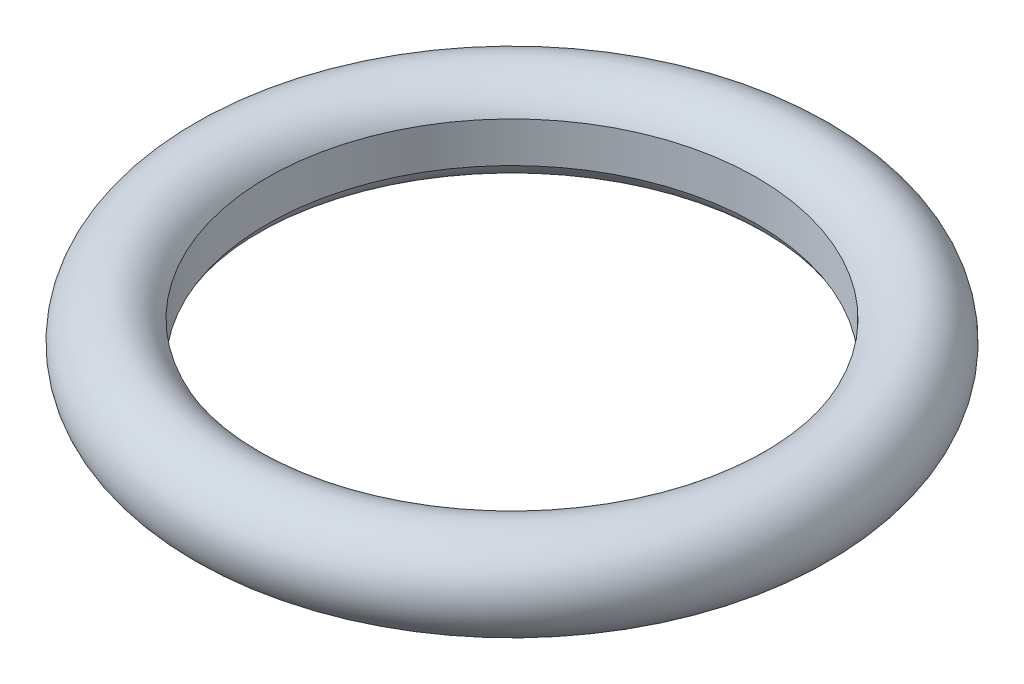
ISO-10303-21;
HEADER;
FILE_DESCRIPTION(('STEP AP214'),'2;1');
FILE_NAME('part.step','',(''),(''),'','','');
FILE_SCHEMA(('AUTOMOTIVE_DESIGN { 1 0 10303 214 1 1 1 1 }'));
ENDSEC;
DATA;
#1=APPLICATION_CONTEXT('core data for automotive mechanical design processes');
#2=APPLICATION_PROTOCOL_DEFINITION('international standard','automotive_design',2000,#1);
#3=PRODUCT_CONTEXT('',#1,'mechanical');
#4=PRODUCT('Part','Part','',(#3));
#5=PRODUCT_RELATED_PRODUCT_CATEGORY('part','',(#4));
#6=PRODUCT_DEFINITION_FORMATION('','',#4);
#7=PRODUCT_DEFINITION_CONTEXT('part definition',#1,'design');
#8=PRODUCT_DEFINITION('design','',#6,#7);
#9=PRODUCT_DEFINITION_SHAPE('','',#8);
#10=(LENGTH_UNIT() NAMED_UNIT(*) SI_UNIT(.MILLI.,.METRE.));
#11=(NAMED_UNIT(*) PLANE_ANGLE_UNIT() SI_UNIT($,.RADIAN.));
#12=(NAMED_UNIT(*) SI_UNIT($,.STERADIAN.) SOLID_ANGLE_UNIT());
#13=UNCERTAINTY_MEASURE_WITH_UNIT(LENGTH_MEASURE(1.E-05),#10,'distance_accuracy_value','');
#14=(GEOMETRIC_REPRESENTATION_CONTEXT(3) GLOBAL_UNCERTAINTY_ASSIGNED_CONTEXT((#13)) GLOBAL_UNIT_ASSIGNED_CONTEXT((#10,
#11,#12)) REPRESENTATION_CONTEXT('',''));
#15=CARTESIAN_POINT('',(0.,0.,0.));
#16=DIRECTION('',(0.,0.,1.));
#17=DIRECTION('',(1.,0.,0.));
#18=AXIS2_PLACEMENT_3D('',#15,#16,#17);
#19=CARTESIAN_POINT('',(0.,0.,0.));
#20=DIRECTION('',(0.,-1.,0.));
#21=DIRECTION('',(0.,0.,-1.));
#22=AXIS2_PLACEMENT_3D('',#19,#20,#21);
#23=TOROIDAL_SURFACE('',#22,5.64392757856117,0.889);
#24=CARTESIAN_POINT('',(0.,-0.4,0.));
#25=DIRECTION('',(0.,-1.,0.));
#26=DIRECTION('',(0.,0.,-1.));
#27=AXIS2_PLACEMENT_3D('',#24,#25,#26);
#28=CIRCLE('',#27,4.85);
#29=CARTESIAN_POINT('',(0.,-0.4,-4.85));
#30=VERTEX_POINT('',#29);
#31=EDGE_CURVE('E10',#30,#30,#28,.T.);
#32=ORIENTED_EDGE('',*,*,#31,.F.);
#33=EDGE_LOOP('',(#32));
#34=FACE_BOUND('',#33,.T.);
#35=CARTESIAN_POINT('',(0.,0.4,0.));
#36=DIRECTION('',(0.,-1.,0.));
#37=DIRECTION('',(0.,0.,-1.));
#38=AXIS2_PLACEMENT_3D('',#35,#36,#37);
#39=CIRCLE('',#38,4.85);
#40=CARTESIAN_POINT('',(0.,0.4,-4.85));
#41=VERTEX_POINT('',#40);
#42=EDGE_CURVE('E36',#41,#41,#39,.T.);
#43=ORIENTED_EDGE('',*,*,#42,.T.);
#44=EDGE_LOOP('',(#43));
#45=FACE_BOUND('',#44,.T.);
#46=ADVANCED_FACE('F30',(#34,#45),#23,.T.);
#47=CARTESIAN_POINT('',(0.,0.,0.));
#48=DIRECTION('',(0.,-1.,0.));
#49=DIRECTION('',(0.,0.,-1.));
#50=AXIS2_PLACEMENT_3D('',#47,#48,#49);
#51=CYLINDRICAL_SURFACE('',#50,4.85);
#52=ORIENTED_EDGE('',*,*,#42,.F.);
#53=EDGE_LOOP('',(#52));
#54=FACE_BOUND('',#53,.T.);
#55=ORIENTED_EDGE('',*,*,#31,.T.);
#56=EDGE_LOOP('',(#55));
#57=FACE_BOUND('',#56,.T.);
#58=ADVANCED_FACE('F43',(#54,#57),#51,.F.);
#59=CLOSED_SHELL('',(#46,#58));
#60=MANIFOLD_SOLID_BREP('B2',#59);
#61=ADVANCED_BREP_SHAPE_REPRESENTATION('',(#18,#60),#14);
#62=SHAPE_DEFINITION_REPRESENTATION(#9,#61);
ENDSEC;
END-ISO-10303-21;
